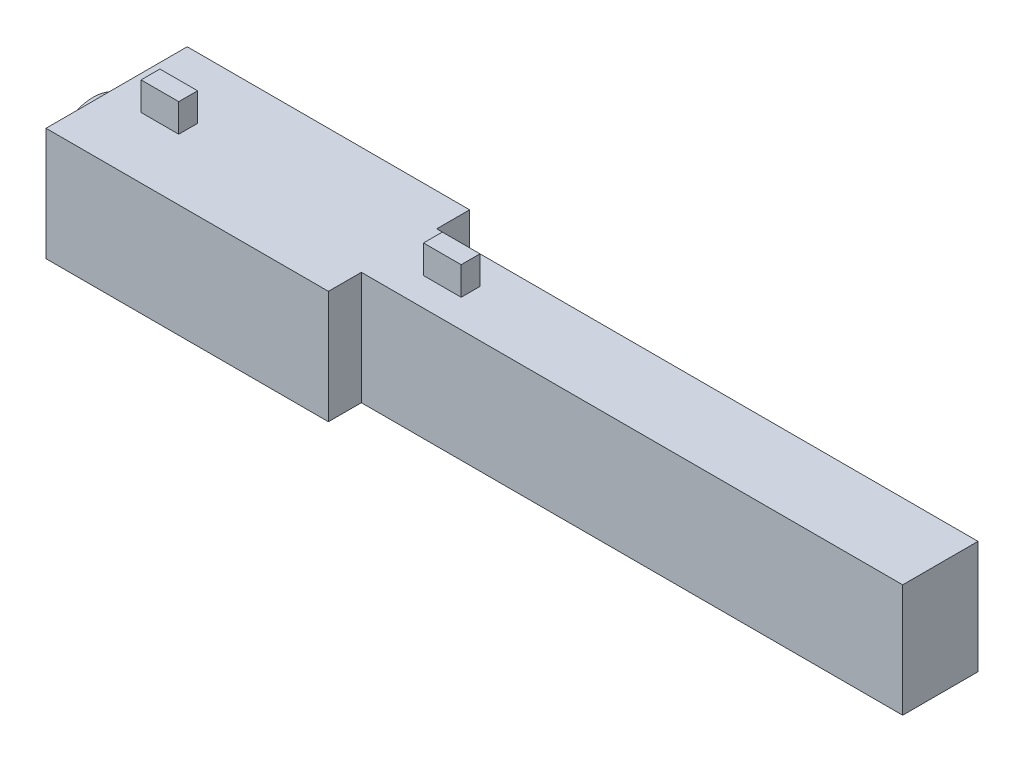
ISO-10303-21;
HEADER;
FILE_DESCRIPTION(('STEP AP214'),'2;1');
FILE_NAME('part.step','',(''),(''),'','','');
FILE_SCHEMA(('AUTOMOTIVE_DESIGN { 1 0 10303 214 1 1 1 1 }'));
ENDSEC;
DATA;
#1=APPLICATION_CONTEXT('core data for automotive mechanical design processes');
#2=APPLICATION_PROTOCOL_DEFINITION('international standard','automotive_design',2000,#1);
#3=PRODUCT_CONTEXT('',#1,'mechanical');
#4=PRODUCT('Part','Part','',(#3));
#5=PRODUCT_RELATED_PRODUCT_CATEGORY('part','',(#4));
#6=PRODUCT_DEFINITION_FORMATION('','',#4);
#7=PRODUCT_DEFINITION_CONTEXT('part definition',#1,'design');
#8=PRODUCT_DEFINITION('design','',#6,#7);
#9=PRODUCT_DEFINITION_SHAPE('','',#8);
#10=(LENGTH_UNIT() NAMED_UNIT(*) SI_UNIT(.MILLI.,.METRE.));
#11=(NAMED_UNIT(*) PLANE_ANGLE_UNIT() SI_UNIT($,.RADIAN.));
#12=(NAMED_UNIT(*) SI_UNIT($,.STERADIAN.) SOLID_ANGLE_UNIT());
#13=UNCERTAINTY_MEASURE_WITH_UNIT(LENGTH_MEASURE(1.E-05),#10,'distance_accuracy_value','');
#14=(GEOMETRIC_REPRESENTATION_CONTEXT(3) GLOBAL_UNCERTAINTY_ASSIGNED_CONTEXT((#13)) GLOBAL_UNIT_ASSIGNED_CONTEXT((#10,
#11,#12)) REPRESENTATION_CONTEXT('',''));
#15=CARTESIAN_POINT('',(0.,0.,0.));
#16=DIRECTION('',(0.,0.,1.));
#17=DIRECTION('',(1.,0.,0.));
#18=AXIS2_PLACEMENT_3D('',#15,#16,#17);
#19=CARTESIAN_POINT('',(-55.5,0.,-7.5));
#20=DIRECTION('',(-1.,0.,0.));
#21=DIRECTION('',(0.,0.,1.));
#22=AXIS2_PLACEMENT_3D('',#19,#20,#21);
#23=PLANE('',#22);
#24=DIRECTION('',(0.,0.,1.));
#25=VECTOR('',#24,1.);
#26=CARTESIAN_POINT('',(-55.5,-6.65,-7.5));
#27=LINE('',#26,#25);
#28=CARTESIAN_POINT('',(-55.5,-6.65,-7.5));
#29=VERTEX_POINT('',#28);
#30=CARTESIAN_POINT('',(-55.5,-6.65,7.5));
#31=VERTEX_POINT('',#30);
#32=EDGE_CURVE('E387',#29,#31,#27,.T.);
#33=ORIENTED_EDGE('',*,*,#32,.T.);
#34=DIRECTION('',(0.,-1.,0.));
#35=VECTOR('',#34,1.);
#36=CARTESIAN_POINT('',(-55.5,0.,7.5));
#37=LINE('',#36,#35);
#38=CARTESIAN_POINT('',(-55.5,5.35,7.5));
#39=VERTEX_POINT('',#38);
#40=EDGE_CURVE('E370',#39,#31,#37,.T.);
#41=ORIENTED_EDGE('',*,*,#40,.F.);
#42=DIRECTION('',(0.,0.,1.));
#43=VECTOR('',#42,1.);
#44=CARTESIAN_POINT('',(-55.5,5.35,-7.5));
#45=LINE('',#44,#43);
#46=CARTESIAN_POINT('',(-55.5,5.35,-7.5));
#47=VERTEX_POINT('',#46);
#48=EDGE_CURVE('E388',#47,#39,#45,.T.);
#49=ORIENTED_EDGE('',*,*,#48,.F.);
#50=DIRECTION('',(0.,-1.,0.));
#51=VECTOR('',#50,1.);
#52=CARTESIAN_POINT('',(-55.5,0.,-7.5));
#53=LINE('',#52,#51);
#54=EDGE_CURVE('E380',#47,#29,#53,.T.);
#55=ORIENTED_EDGE('',*,*,#54,.T.);
#56=EDGE_LOOP('',(#33,#41,#49,#55));
#57=FACE_BOUND('',#56,.T.);
#58=CARTESIAN_POINT('',(-55.5,-1.3,0.));
#59=DIRECTION('',(-1.,0.,0.));
#60=DIRECTION('',(0.,0.,1.));
#61=AXIS2_PLACEMENT_3D('',#58,#59,#60);
#62=CIRCLE('',#61,4.5);
#63=CARTESIAN_POINT('',(-55.5,-1.3,4.5));
#64=VERTEX_POINT('',#63);
#65=EDGE_CURVE('E653',#64,#64,#62,.T.);
#66=ORIENTED_EDGE('',*,*,#65,.F.);
#67=EDGE_LOOP('',(#66));
#68=FACE_BOUND('',#67,.T.);
#69=ADVANCED_FACE('F47',(#57,#68),#23,.T.);
#70=CARTESIAN_POINT('',(0.,-6.65,-7.5));
#71=DIRECTION('',(0.,-1.,0.));
#72=DIRECTION('',(0.,0.,-1.));
#73=AXIS2_PLACEMENT_3D('',#70,#71,#72);
#74=PLANE('',#73);
#75=DIRECTION('',(0.,0.,1.));
#76=VECTOR('',#75,1.);
#77=CARTESIAN_POINT('',(-25.5,-6.65,-7.5));
#78=LINE('',#77,#76);
#79=CARTESIAN_POINT('',(-25.5,-6.65,-7.5));
#80=VERTEX_POINT('',#79);
#81=CARTESIAN_POINT('',(-25.5,-6.65,-4.));
#82=VERTEX_POINT('',#81);
#83=EDGE_CURVE('E13',#80,#82,#78,.T.);
#84=ORIENTED_EDGE('',*,*,#83,.T.);
#85=DIRECTION('',(1.,0.,0.));
#86=VECTOR('',#85,1.);
#87=CARTESIAN_POINT('',(0.,-6.65,-4.));
#88=LINE('',#87,#86);
#89=CARTESIAN_POINT('',(32.,-6.65,-4.));
#90=VERTEX_POINT('',#89);
#91=EDGE_CURVE('E354',#82,#90,#88,.T.);
#92=ORIENTED_EDGE('',*,*,#91,.T.);
#93=DIRECTION('',(0.,0.,1.));
#94=VECTOR('',#93,1.);
#95=CARTESIAN_POINT('',(32.,-6.65,-4.));
#96=LINE('',#95,#94);
#97=CARTESIAN_POINT('',(32.,-6.65,4.));
#98=VERTEX_POINT('',#97);
#99=EDGE_CURVE('E360',#90,#98,#96,.T.);
#100=ORIENTED_EDGE('',*,*,#99,.T.);
#101=DIRECTION('',(1.,0.,0.));
#102=VECTOR('',#101,1.);
#103=CARTESIAN_POINT('',(0.,-6.65,4.));
#104=LINE('',#103,#102);
#105=CARTESIAN_POINT('',(-25.5,-6.65,4.));
#106=VERTEX_POINT('',#105);
#107=EDGE_CURVE('E343',#106,#98,#104,.T.);
#108=ORIENTED_EDGE('',*,*,#107,.F.);
#109=CARTESIAN_POINT('',(-25.5,-6.65,7.5));
#110=VERTEX_POINT('',#109);
#111=EDGE_CURVE('E56',#106,#110,#78,.T.);
#112=ORIENTED_EDGE('',*,*,#111,.T.);
#113=DIRECTION('',(1.,0.,0.));
#114=VECTOR('',#113,1.);
#115=CARTESIAN_POINT('',(0.,-6.65,7.5));
#116=LINE('',#115,#114);
#117=EDGE_CURVE('E373',#31,#110,#116,.T.);
#118=ORIENTED_EDGE('',*,*,#117,.F.);
#119=ORIENTED_EDGE('',*,*,#32,.F.);
#120=DIRECTION('',(1.,0.,0.));
#121=VECTOR('',#120,1.);
#122=CARTESIAN_POINT('',(0.,-6.65,-7.5));
#123=LINE('',#122,#121);
#124=EDGE_CURVE('E383',#29,#80,#123,.T.);
#125=ORIENTED_EDGE('',*,*,#124,.T.);
#126=EDGE_LOOP('',(#84,#92,#100,#108,#112,#118,#119,#125));
#127=FACE_BOUND('',#126,.T.);
#128=DIRECTION('',(-1.,0.,0.));
#129=VECTOR('',#128,1.);
#130=CARTESIAN_POINT('',(-51.9,-6.65,1.));
#131=LINE('',#130,#129);
#132=CARTESIAN_POINT('',(-47.9,-6.65,1.));
#133=VERTEX_POINT('',#132);
#134=CARTESIAN_POINT('',(-51.9,-6.65,1.));
#135=VERTEX_POINT('',#134);
#136=EDGE_CURVE('E293',#133,#135,#131,.T.);
#137=ORIENTED_EDGE('',*,*,#136,.F.);
#138=DIRECTION('',(0.,0.,1.));
#139=VECTOR('',#138,1.);
#140=CARTESIAN_POINT('',(-47.9,-6.65,0.));
#141=LINE('',#140,#139);
#142=CARTESIAN_POINT('',(-47.9,-6.65,-1.));
#143=VERTEX_POINT('',#142);
#144=EDGE_CURVE('E275',#143,#133,#141,.T.);
#145=ORIENTED_EDGE('',*,*,#144,.F.);
#146=DIRECTION('',(1.,0.,0.));
#147=VECTOR('',#146,1.);
#148=CARTESIAN_POINT('',(-47.9,-6.65,-1.));
#149=LINE('',#148,#147);
#150=CARTESIAN_POINT('',(-51.9,-6.65,-1.));
#151=VERTEX_POINT('',#150);
#152=EDGE_CURVE('E285',#151,#143,#149,.T.);
#153=ORIENTED_EDGE('',*,*,#152,.F.);
#154=DIRECTION('',(0.,0.,-1.));
#155=VECTOR('',#154,1.);
#156=CARTESIAN_POINT('',(-51.9,-6.65,0.));
#157=LINE('',#156,#155);
#158=EDGE_CURVE('E295',#135,#151,#157,.T.);
#159=ORIENTED_EDGE('',*,*,#158,.F.);
#160=EDGE_LOOP('',(#137,#145,#153,#159));
#161=FACE_BOUND('',#160,.T.);
#162=DIRECTION('',(0.,0.,1.));
#163=VECTOR('',#162,1.);
#164=CARTESIAN_POINT('',(-17.9,-6.65,0.));
#165=LINE('',#164,#163);
#166=CARTESIAN_POINT('',(-17.9,-6.65,-1.));
#167=VERTEX_POINT('',#166);
#168=CARTESIAN_POINT('',(-17.9,-6.65,1.));
#169=VERTEX_POINT('',#168);
#170=EDGE_CURVE('E323',#167,#169,#165,.T.);
#171=ORIENTED_EDGE('',*,*,#170,.F.);
#172=DIRECTION('',(1.,0.,0.));
#173=VECTOR('',#172,1.);
#174=CARTESIAN_POINT('',(-21.9,-6.65,-1.));
#175=LINE('',#174,#173);
#176=CARTESIAN_POINT('',(-21.9,-6.65,-1.));
#177=VERTEX_POINT('',#176);
#178=EDGE_CURVE('E309',#177,#167,#175,.T.);
#179=ORIENTED_EDGE('',*,*,#178,.F.);
#180=DIRECTION('',(0.,0.,-1.));
#181=VECTOR('',#180,1.);
#182=CARTESIAN_POINT('',(-21.9,-6.65,1.));
#183=LINE('',#182,#181);
#184=CARTESIAN_POINT('',(-21.9,-6.65,1.));
#185=VERTEX_POINT('',#184);
#186=EDGE_CURVE('E314',#185,#177,#183,.T.);
#187=ORIENTED_EDGE('',*,*,#186,.F.);
#188=DIRECTION('',(-1.,0.,0.));
#189=VECTOR('',#188,1.);
#190=CARTESIAN_POINT('',(-17.9,-6.65,1.));
#191=LINE('',#190,#189);
#192=EDGE_CURVE('E325',#169,#185,#191,.T.);
#193=ORIENTED_EDGE('',*,*,#192,.F.);
#194=EDGE_LOOP('',(#171,#179,#187,#193));
#195=FACE_BOUND('',#194,.T.);
#196=ADVANCED_FACE('F435',(#127,#161,#195),#74,.T.);
#197=CARTESIAN_POINT('',(-25.5,0.,-7.5));
#198=DIRECTION('',(-1.,0.,0.));
#199=DIRECTION('',(0.,0.,1.));
#200=AXIS2_PLACEMENT_3D('',#197,#198,#199);
#201=PLANE('',#200);
#202=DIRECTION('',(0.,-1.,0.));
#203=VECTOR('',#202,1.);
#204=CARTESIAN_POINT('',(-25.5,0.,4.));
#205=LINE('',#204,#203);
#206=CARTESIAN_POINT('',(-25.5,5.35,4.));
#207=VERTEX_POINT('',#206);
#208=EDGE_CURVE('E341',#207,#106,#205,.T.);
#209=ORIENTED_EDGE('',*,*,#208,.F.);
#210=DIRECTION('',(0.,0.,1.));
#211=VECTOR('',#210,1.);
#212=CARTESIAN_POINT('',(-25.5,5.35,-7.5));
#213=LINE('',#212,#211);
#214=CARTESIAN_POINT('',(-25.5,5.35,7.5));
#215=VERTEX_POINT('',#214);
#216=EDGE_CURVE('E385',#207,#215,#213,.T.);
#217=ORIENTED_EDGE('',*,*,#216,.T.);
#218=DIRECTION('',(0.,-1.,0.));
#219=VECTOR('',#218,1.);
#220=CARTESIAN_POINT('',(-25.5,0.,7.5));
#221=LINE('',#220,#219);
#222=EDGE_CURVE('E363',#215,#110,#221,.T.);
#223=ORIENTED_EDGE('',*,*,#222,.T.);
#224=ORIENTED_EDGE('',*,*,#111,.F.);
#225=EDGE_LOOP('',(#209,#217,#223,#224));
#226=FACE_BOUND('',#225,.T.);
#227=ADVANCED_FACE('F400',(#226),#201,.F.);
#228=CARTESIAN_POINT('',(-25.5,5.35,-7.5));
#229=VERTEX_POINT('',#228);
#230=CARTESIAN_POINT('',(-25.5,5.35,-4.));
#231=VERTEX_POINT('',#230);
#232=EDGE_CURVE('E51',#229,#231,#213,.T.);
#233=ORIENTED_EDGE('',*,*,#232,.T.);
#234=DIRECTION('',(0.,-1.,0.));
#235=VECTOR('',#234,1.);
#236=CARTESIAN_POINT('',(-25.5,0.,-4.));
#237=LINE('',#236,#235);
#238=EDGE_CURVE('E351',#231,#82,#237,.T.);
#239=ORIENTED_EDGE('',*,*,#238,.T.);
#240=ORIENTED_EDGE('',*,*,#83,.F.);
#241=DIRECTION('',(0.,-1.,0.));
#242=VECTOR('',#241,1.);
#243=CARTESIAN_POINT('',(-25.5,0.,-7.5));
#244=LINE('',#243,#242);
#245=EDGE_CURVE('E376',#229,#80,#244,.T.);
#246=ORIENTED_EDGE('',*,*,#245,.F.);
#247=EDGE_LOOP('',(#233,#239,#240,#246));
#248=FACE_BOUND('',#247,.T.);
#249=ADVANCED_FACE('F49',(#248),#201,.F.);
#250=CARTESIAN_POINT('',(0.,5.35,-7.5));
#251=DIRECTION('',(0.,-1.,0.));
#252=DIRECTION('',(0.,0.,-1.));
#253=AXIS2_PLACEMENT_3D('',#250,#251,#252);
#254=PLANE('',#253);
#255=DIRECTION('',(0.,0.,-1.));
#256=VECTOR('',#255,1.);
#257=CARTESIAN_POINT('',(-51.9,5.35,0.));
#258=LINE('',#257,#256);
#259=CARTESIAN_POINT('',(-51.9,5.35,0.999999999999999));
#260=VERTEX_POINT('',#259);
#261=CARTESIAN_POINT('',(-51.9,5.35,-1.));
#262=VERTEX_POINT('',#261);
#263=EDGE_CURVE('E242',#260,#262,#258,.T.);
#264=ORIENTED_EDGE('',*,*,#263,.T.);
#265=DIRECTION('',(1.,0.,0.));
#266=VECTOR('',#265,1.);
#267=CARTESIAN_POINT('',(-51.9,5.35,-1.));
#268=LINE('',#267,#266);
#269=CARTESIAN_POINT('',(-47.9,5.35,-0.999999999999999));
#270=VERTEX_POINT('',#269);
#271=EDGE_CURVE('E223',#262,#270,#268,.T.);
#272=ORIENTED_EDGE('',*,*,#271,.T.);
#273=DIRECTION('',(0.,0.,1.));
#274=VECTOR('',#273,1.);
#275=CARTESIAN_POINT('',(-47.9,5.35,0.));
#276=LINE('',#275,#274);
#277=CARTESIAN_POINT('',(-47.9,5.35,0.999999999999999));
#278=VERTEX_POINT('',#277);
#279=EDGE_CURVE('E238',#270,#278,#276,.T.);
#280=ORIENTED_EDGE('',*,*,#279,.T.);
#281=DIRECTION('',(-1.,0.,0.));
#282=VECTOR('',#281,1.);
#283=CARTESIAN_POINT('',(-47.9,5.35,0.999999999999999));
#284=LINE('',#283,#282);
#285=EDGE_CURVE('E64',#278,#260,#284,.T.);
#286=ORIENTED_EDGE('',*,*,#285,.T.);
#287=EDGE_LOOP('',(#264,#272,#280,#286));
#288=FACE_BOUND('',#287,.T.);
#289=ORIENTED_EDGE('',*,*,#216,.F.);
#290=DIRECTION('',(1.,0.,0.));
#291=VECTOR('',#290,1.);
#292=CARTESIAN_POINT('',(0.,5.35,4.));
#293=LINE('',#292,#291);
#294=CARTESIAN_POINT('',(32.,5.35,4.));
#295=VERTEX_POINT('',#294);
#296=EDGE_CURVE('E338',#207,#295,#293,.T.);
#297=ORIENTED_EDGE('',*,*,#296,.T.);
#298=DIRECTION('',(0.,0.,1.));
#299=VECTOR('',#298,1.);
#300=CARTESIAN_POINT('',(32.,5.35,-4.));
#301=LINE('',#300,#299);
#302=CARTESIAN_POINT('',(32.,5.35,-4.));
#303=VERTEX_POINT('',#302);
#304=EDGE_CURVE('E361',#303,#295,#301,.T.);
#305=ORIENTED_EDGE('',*,*,#304,.F.);
#306=DIRECTION('',(1.,0.,0.));
#307=VECTOR('',#306,1.);
#308=CARTESIAN_POINT('',(0.,5.35,-4.));
#309=LINE('',#308,#307);
#310=EDGE_CURVE('E349',#231,#303,#309,.T.);
#311=ORIENTED_EDGE('',*,*,#310,.F.);
#312=ORIENTED_EDGE('',*,*,#232,.F.);
#313=DIRECTION('',(1.,0.,0.));
#314=VECTOR('',#313,1.);
#315=CARTESIAN_POINT('',(0.,5.35,-7.5));
#316=LINE('',#315,#314);
#317=EDGE_CURVE('E378',#47,#229,#316,.T.);
#318=ORIENTED_EDGE('',*,*,#317,.F.);
#319=ORIENTED_EDGE('',*,*,#48,.T.);
#320=DIRECTION('',(1.,0.,0.));
#321=VECTOR('',#320,1.);
#322=CARTESIAN_POINT('',(0.,5.35,7.5));
#323=LINE('',#322,#321);
#324=EDGE_CURVE('E367',#39,#215,#323,.T.);
#325=ORIENTED_EDGE('',*,*,#324,.T.);
#326=EDGE_LOOP('',(#289,#297,#305,#311,#312,#318,#319,#325));
#327=FACE_BOUND('',#326,.T.);
#328=DIRECTION('',(0.,0.,-1.));
#329=VECTOR('',#328,1.);
#330=CARTESIAN_POINT('',(-21.9,5.35,0.999999999999999));
#331=LINE('',#330,#329);
#332=CARTESIAN_POINT('',(-21.9,5.35,0.999999999999999));
#333=VERTEX_POINT('',#332);
#334=CARTESIAN_POINT('',(-21.9,5.35,-0.999999999999997));
#335=VERTEX_POINT('',#334);
#336=EDGE_CURVE('E256',#333,#335,#331,.T.);
#337=ORIENTED_EDGE('',*,*,#336,.T.);
#338=DIRECTION('',(1.,0.,0.));
#339=VECTOR('',#338,1.);
#340=CARTESIAN_POINT('',(-21.9,5.35,-0.999999999999997));
#341=LINE('',#340,#339);
#342=CARTESIAN_POINT('',(-17.9,5.35,-0.999999999999997));
#343=VERTEX_POINT('',#342);
#344=EDGE_CURVE('E248',#335,#343,#341,.T.);
#345=ORIENTED_EDGE('',*,*,#344,.T.);
#346=DIRECTION('',(0.,0.,1.));
#347=VECTOR('',#346,1.);
#348=CARTESIAN_POINT('',(-17.9,5.35,0.));
#349=LINE('',#348,#347);
#350=CARTESIAN_POINT('',(-17.9,5.35,0.999999999999999));
#351=VERTEX_POINT('',#350);
#352=EDGE_CURVE('E267',#343,#351,#349,.T.);
#353=ORIENTED_EDGE('',*,*,#352,.T.);
#354=DIRECTION('',(-1.,0.,0.));
#355=VECTOR('',#354,1.);
#356=CARTESIAN_POINT('',(-17.9,5.35,0.999999999999999));
#357=LINE('',#356,#355);
#358=EDGE_CURVE('E72',#351,#333,#357,.T.);
#359=ORIENTED_EDGE('',*,*,#358,.T.);
#360=EDGE_LOOP('',(#337,#345,#353,#359));
#361=FACE_BOUND('',#360,.T.);
#362=ADVANCED_FACE('F406',(#288,#327,#361),#254,.F.);
#363=CARTESIAN_POINT('',(0.,0.,-7.5));
#364=DIRECTION('',(0.,0.,1.));
#365=DIRECTION('',(1.,0.,0.));
#366=AXIS2_PLACEMENT_3D('',#363,#364,#365);
#367=PLANE('',#366);
#368=ORIENTED_EDGE('',*,*,#245,.T.);
#369=ORIENTED_EDGE('',*,*,#124,.F.);
#370=ORIENTED_EDGE('',*,*,#54,.F.);
#371=ORIENTED_EDGE('',*,*,#317,.T.);
#372=EDGE_LOOP('',(#368,#369,#370,#371));
#373=FACE_BOUND('',#372,.T.);
#374=ADVANCED_FACE('F409',(#373),#367,.F.);
#375=CARTESIAN_POINT('',(0.,0.,7.5));
#376=DIRECTION('',(0.,0.,1.));
#377=DIRECTION('',(1.,0.,0.));
#378=AXIS2_PLACEMENT_3D('',#375,#376,#377);
#379=PLANE('',#378);
#380=ORIENTED_EDGE('',*,*,#222,.F.);
#381=ORIENTED_EDGE('',*,*,#324,.F.);
#382=ORIENTED_EDGE('',*,*,#40,.T.);
#383=ORIENTED_EDGE('',*,*,#117,.T.);
#384=EDGE_LOOP('',(#380,#381,#382,#383));
#385=FACE_BOUND('',#384,.T.);
#386=ADVANCED_FACE('F404',(#385),#379,.T.);
#387=CARTESIAN_POINT('',(32.,0.,-4.));
#388=DIRECTION('',(1.,0.,0.));
#389=DIRECTION('',(0.,0.,-1.));
#390=AXIS2_PLACEMENT_3D('',#387,#388,#389);
#391=PLANE('',#390);
#392=ORIENTED_EDGE('',*,*,#304,.T.);
#393=DIRECTION('',(0.,1.,0.));
#394=VECTOR('',#393,1.);
#395=CARTESIAN_POINT('',(32.,0.,4.));
#396=LINE('',#395,#394);
#397=EDGE_CURVE('E346',#98,#295,#396,.T.);
#398=ORIENTED_EDGE('',*,*,#397,.F.);
#399=ORIENTED_EDGE('',*,*,#99,.F.);
#400=DIRECTION('',(0.,1.,0.));
#401=VECTOR('',#400,1.);
#402=CARTESIAN_POINT('',(32.,0.,-4.));
#403=LINE('',#402,#401);
#404=EDGE_CURVE('E357',#90,#303,#403,.T.);
#405=ORIENTED_EDGE('',*,*,#404,.T.);
#406=EDGE_LOOP('',(#392,#398,#399,#405));
#407=FACE_BOUND('',#406,.T.);
#408=ADVANCED_FACE('F450',(#407),#391,.T.);
#409=CARTESIAN_POINT('',(0.,0.,-4.));
#410=DIRECTION('',(0.,0.,1.));
#411=DIRECTION('',(1.,0.,0.));
#412=AXIS2_PLACEMENT_3D('',#409,#410,#411);
#413=PLANE('',#412);
#414=ORIENTED_EDGE('',*,*,#310,.T.);
#415=ORIENTED_EDGE('',*,*,#404,.F.);
#416=ORIENTED_EDGE('',*,*,#91,.F.);
#417=ORIENTED_EDGE('',*,*,#238,.F.);
#418=EDGE_LOOP('',(#414,#415,#416,#417));
#419=FACE_BOUND('',#418,.T.);
#420=ADVANCED_FACE('F453',(#419),#413,.F.);
#421=CARTESIAN_POINT('',(0.,0.,4.));
#422=DIRECTION('',(0.,0.,1.));
#423=DIRECTION('',(1.,0.,0.));
#424=AXIS2_PLACEMENT_3D('',#421,#422,#423);
#425=PLANE('',#424);
#426=ORIENTED_EDGE('',*,*,#296,.F.);
#427=ORIENTED_EDGE('',*,*,#208,.T.);
#428=ORIENTED_EDGE('',*,*,#107,.T.);
#429=ORIENTED_EDGE('',*,*,#397,.T.);
#430=EDGE_LOOP('',(#426,#427,#428,#429));
#431=FACE_BOUND('',#430,.T.);
#432=ADVANCED_FACE('F457',(#431),#425,.T.);
#433=CARTESIAN_POINT('',(-21.9,-9.65,-1.));
#434=DIRECTION('',(0.,0.,1.));
#435=DIRECTION('',(1.,0.,0.));
#436=AXIS2_PLACEMENT_3D('',#433,#434,#435);
#437=PLANE('',#436);
#438=ORIENTED_EDGE('',*,*,#178,.T.);
#439=DIRECTION('',(0.,1.,0.));
#440=VECTOR('',#439,1.);
#441=CARTESIAN_POINT('',(-17.9,-9.65,-1.));
#442=LINE('',#441,#440);
#443=CARTESIAN_POINT('',(-17.9,-9.65,-1.));
#444=VERTEX_POINT('',#443);
#445=EDGE_CURVE('E336',#444,#167,#442,.T.);
#446=ORIENTED_EDGE('',*,*,#445,.F.);
#447=DIRECTION('',(1.,0.,0.));
#448=VECTOR('',#447,1.);
#449=CARTESIAN_POINT('',(-21.9,-9.65,-1.));
#450=LINE('',#449,#448);
#451=CARTESIAN_POINT('',(-21.9,-9.65,-1.));
#452=VERTEX_POINT('',#451);
#453=EDGE_CURVE('E310',#452,#444,#450,.T.);
#454=ORIENTED_EDGE('',*,*,#453,.F.);
#455=DIRECTION('',(0.,1.,0.));
#456=VECTOR('',#455,1.);
#457=CARTESIAN_POINT('',(-21.9,-9.65,-1.));
#458=LINE('',#457,#456);
#459=EDGE_CURVE('E320',#452,#177,#458,.T.);
#460=ORIENTED_EDGE('',*,*,#459,.T.);
#461=EDGE_LOOP('',(#438,#446,#454,#460));
#462=FACE_BOUND('',#461,.T.);
#463=ADVANCED_FACE('F461',(#462),#437,.F.);
#464=CARTESIAN_POINT('',(-17.9,-9.65,0.));
#465=DIRECTION('',(-1.,0.,0.));
#466=DIRECTION('',(0.,0.,1.));
#467=AXIS2_PLACEMENT_3D('',#464,#465,#466);
#468=PLANE('',#467);
#469=ORIENTED_EDGE('',*,*,#170,.T.);
#470=DIRECTION('',(0.,1.,0.));
#471=VECTOR('',#470,1.);
#472=CARTESIAN_POINT('',(-17.9,-9.65,1.));
#473=LINE('',#472,#471);
#474=CARTESIAN_POINT('',(-17.9,-9.65,1.));
#475=VERTEX_POINT('',#474);
#476=EDGE_CURVE('E333',#475,#169,#473,.T.);
#477=ORIENTED_EDGE('',*,*,#476,.F.);
#478=DIRECTION('',(0.,0.,1.));
#479=VECTOR('',#478,1.);
#480=CARTESIAN_POINT('',(-17.9,-9.65,-1.));
#481=LINE('',#480,#479);
#482=EDGE_CURVE('E313',#444,#475,#481,.T.);
#483=ORIENTED_EDGE('',*,*,#482,.F.);
#484=ORIENTED_EDGE('',*,*,#445,.T.);
#485=EDGE_LOOP('',(#469,#477,#483,#484));
#486=FACE_BOUND('',#485,.T.);
#487=ADVANCED_FACE('F465',(#486),#468,.F.);
#488=CARTESIAN_POINT('',(-17.9,-9.65,1.));
#489=DIRECTION('',(0.,0.,-1.));
#490=DIRECTION('',(-1.,0.,0.));
#491=AXIS2_PLACEMENT_3D('',#488,#489,#490);
#492=PLANE('',#491);
#493=ORIENTED_EDGE('',*,*,#192,.T.);
#494=DIRECTION('',(0.,1.,0.));
#495=VECTOR('',#494,1.);
#496=CARTESIAN_POINT('',(-21.9,-9.65,1.));
#497=LINE('',#496,#495);
#498=CARTESIAN_POINT('',(-21.9,-9.65,1.));
#499=VERTEX_POINT('',#498);
#500=EDGE_CURVE('E331',#499,#185,#497,.T.);
#501=ORIENTED_EDGE('',*,*,#500,.F.);
#502=DIRECTION('',(-1.,0.,0.));
#503=VECTOR('',#502,1.);
#504=CARTESIAN_POINT('',(-17.9,-9.65,1.));
#505=LINE('',#504,#503);
#506=EDGE_CURVE('E316',#475,#499,#505,.T.);
#507=ORIENTED_EDGE('',*,*,#506,.F.);
#508=ORIENTED_EDGE('',*,*,#476,.T.);
#509=EDGE_LOOP('',(#493,#501,#507,#508));
#510=FACE_BOUND('',#509,.T.);
#511=ADVANCED_FACE('F469',(#510),#492,.F.);
#512=CARTESIAN_POINT('',(-21.9,-9.65,1.));
#513=DIRECTION('',(1.,0.,0.));
#514=DIRECTION('',(0.,0.,-1.));
#515=AXIS2_PLACEMENT_3D('',#512,#513,#514);
#516=PLANE('',#515);
#517=ORIENTED_EDGE('',*,*,#186,.T.);
#518=ORIENTED_EDGE('',*,*,#459,.F.);
#519=DIRECTION('',(0.,0.,-1.));
#520=VECTOR('',#519,1.);
#521=CARTESIAN_POINT('',(-21.9,-9.65,1.));
#522=LINE('',#521,#520);
#523=EDGE_CURVE('E318',#499,#452,#522,.T.);
#524=ORIENTED_EDGE('',*,*,#523,.F.);
#525=ORIENTED_EDGE('',*,*,#500,.T.);
#526=EDGE_LOOP('',(#517,#518,#524,#525));
#527=FACE_BOUND('',#526,.T.);
#528=ADVANCED_FACE('F473',(#527),#516,.F.);
#529=CARTESIAN_POINT('',(0.,-9.65,0.));
#530=DIRECTION('',(0.,-1.,0.));
#531=DIRECTION('',(0.,0.,-1.));
#532=AXIS2_PLACEMENT_3D('',#529,#530,#531);
#533=PLANE('',#532);
#534=ORIENTED_EDGE('',*,*,#453,.T.);
#535=ORIENTED_EDGE('',*,*,#482,.T.);
#536=ORIENTED_EDGE('',*,*,#506,.T.);
#537=ORIENTED_EDGE('',*,*,#523,.T.);
#538=EDGE_LOOP('',(#534,#535,#536,#537));
#539=FACE_BOUND('',#538,.T.);
#540=ADVANCED_FACE('F477',(#539),#533,.T.);
#541=CARTESIAN_POINT('',(-47.9,-9.65,0.));
#542=DIRECTION('',(-1.,0.,0.));
#543=DIRECTION('',(0.,0.,1.));
#544=AXIS2_PLACEMENT_3D('',#541,#542,#543);
#545=PLANE('',#544);
#546=ORIENTED_EDGE('',*,*,#144,.T.);
#547=DIRECTION('',(0.,1.,0.));
#548=VECTOR('',#547,1.);
#549=CARTESIAN_POINT('',(-47.9,-9.65,1.));
#550=LINE('',#549,#548);
#551=CARTESIAN_POINT('',(-47.9,-9.65,1.));
#552=VERTEX_POINT('',#551);
#553=EDGE_CURVE('E306',#552,#133,#550,.T.);
#554=ORIENTED_EDGE('',*,*,#553,.F.);
#555=DIRECTION('',(0.,0.,1.));
#556=VECTOR('',#555,1.);
#557=CARTESIAN_POINT('',(-47.9,-9.65,0.));
#558=LINE('',#557,#556);
#559=CARTESIAN_POINT('',(-47.9,-9.65,-1.));
#560=VERTEX_POINT('',#559);
#561=EDGE_CURVE('E282',#560,#552,#558,.T.);
#562=ORIENTED_EDGE('',*,*,#561,.F.);
#563=DIRECTION('',(0.,1.,0.));
#564=VECTOR('',#563,1.);
#565=CARTESIAN_POINT('',(-47.9,-9.65,-1.));
#566=LINE('',#565,#564);
#567=EDGE_CURVE('E291',#560,#143,#566,.T.);
#568=ORIENTED_EDGE('',*,*,#567,.T.);
#569=EDGE_LOOP('',(#546,#554,#562,#568));
#570=FACE_BOUND('',#569,.T.);
#571=ADVANCED_FACE('F481',(#570),#545,.F.);
#572=CARTESIAN_POINT('',(-51.9,-9.65,1.));
#573=DIRECTION('',(0.,0.,-1.));
#574=DIRECTION('',(-1.,0.,0.));
#575=AXIS2_PLACEMENT_3D('',#572,#573,#574);
#576=PLANE('',#575);
#577=ORIENTED_EDGE('',*,*,#136,.T.);
#578=DIRECTION('',(0.,1.,0.));
#579=VECTOR('',#578,1.);
#580=CARTESIAN_POINT('',(-51.9,-9.65,1.));
#581=LINE('',#580,#579);
#582=CARTESIAN_POINT('',(-51.9,-9.65,1.));
#583=VERTEX_POINT('',#582);
#584=EDGE_CURVE('E303',#583,#135,#581,.T.);
#585=ORIENTED_EDGE('',*,*,#584,.F.);
#586=DIRECTION('',(-1.,0.,0.));
#587=VECTOR('',#586,1.);
#588=CARTESIAN_POINT('',(-51.9,-9.65,1.));
#589=LINE('',#588,#587);
#590=EDGE_CURVE('E284',#552,#583,#589,.T.);
#591=ORIENTED_EDGE('',*,*,#590,.F.);
#592=ORIENTED_EDGE('',*,*,#553,.T.);
#593=EDGE_LOOP('',(#577,#585,#591,#592));
#594=FACE_BOUND('',#593,.T.);
#595=ADVANCED_FACE('F485',(#594),#576,.F.);
#596=CARTESIAN_POINT('',(-51.9,-9.65,0.));
#597=DIRECTION('',(1.,0.,0.));
#598=DIRECTION('',(0.,0.,-1.));
#599=AXIS2_PLACEMENT_3D('',#596,#597,#598);
#600=PLANE('',#599);
#601=ORIENTED_EDGE('',*,*,#158,.T.);
#602=DIRECTION('',(0.,1.,0.));
#603=VECTOR('',#602,1.);
#604=CARTESIAN_POINT('',(-51.9,-9.65,-1.));
#605=LINE('',#604,#603);
#606=CARTESIAN_POINT('',(-51.9,-9.65,-1.));
#607=VERTEX_POINT('',#606);
#608=EDGE_CURVE('E301',#607,#151,#605,.T.);
#609=ORIENTED_EDGE('',*,*,#608,.F.);
#610=DIRECTION('',(0.,0.,-1.));
#611=VECTOR('',#610,1.);
#612=CARTESIAN_POINT('',(-51.9,-9.65,0.));
#613=LINE('',#612,#611);
#614=EDGE_CURVE('E287',#583,#607,#613,.T.);
#615=ORIENTED_EDGE('',*,*,#614,.F.);
#616=ORIENTED_EDGE('',*,*,#584,.T.);
#617=EDGE_LOOP('',(#601,#609,#615,#616));
#618=FACE_BOUND('',#617,.T.);
#619=ADVANCED_FACE('F489',(#618),#600,.F.);
#620=CARTESIAN_POINT('',(-47.9,-9.65,-1.));
#621=DIRECTION('',(0.,0.,1.));
#622=DIRECTION('',(1.,0.,0.));
#623=AXIS2_PLACEMENT_3D('',#620,#621,#622);
#624=PLANE('',#623);
#625=ORIENTED_EDGE('',*,*,#152,.T.);
#626=ORIENTED_EDGE('',*,*,#567,.F.);
#627=DIRECTION('',(1.,0.,0.));
#628=VECTOR('',#627,1.);
#629=CARTESIAN_POINT('',(-47.9,-9.65,-1.));
#630=LINE('',#629,#628);
#631=EDGE_CURVE('E289',#607,#560,#630,.T.);
#632=ORIENTED_EDGE('',*,*,#631,.F.);
#633=ORIENTED_EDGE('',*,*,#608,.T.);
#634=EDGE_LOOP('',(#625,#626,#632,#633));
#635=FACE_BOUND('',#634,.T.);
#636=ADVANCED_FACE('F493',(#635),#624,.F.);
#637=CARTESIAN_POINT('',(0.,-9.65,0.));
#638=DIRECTION('',(0.,1.,0.));
#639=DIRECTION('',(0.,0.,1.));
#640=AXIS2_PLACEMENT_3D('',#637,#638,#639);
#641=PLANE('',#640);
#642=ORIENTED_EDGE('',*,*,#561,.T.);
#643=ORIENTED_EDGE('',*,*,#590,.T.);
#644=ORIENTED_EDGE('',*,*,#614,.T.);
#645=ORIENTED_EDGE('',*,*,#631,.T.);
#646=EDGE_LOOP('',(#642,#643,#644,#645));
#647=FACE_BOUND('',#646,.T.);
#648=ADVANCED_FACE('F497',(#647),#641,.F.);
#649=CARTESIAN_POINT('',(-21.9,8.35,-0.999999999999997));
#650=DIRECTION('',(0.,0.,-1.));
#651=DIRECTION('',(-1.,0.,0.));
#652=AXIS2_PLACEMENT_3D('',#649,#650,#651);
#653=PLANE('',#652);
#654=ORIENTED_EDGE('',*,*,#344,.F.);
#655=DIRECTION('',(0.,-1.,0.));
#656=VECTOR('',#655,1.);
#657=CARTESIAN_POINT('',(-21.9,8.35,-0.999999999999997));
#658=LINE('',#657,#656);
#659=CARTESIAN_POINT('',(-21.9,8.35,-0.999999999999997));
#660=VERTEX_POINT('',#659);
#661=EDGE_CURVE('E273',#660,#335,#658,.T.);
#662=ORIENTED_EDGE('',*,*,#661,.F.);
#663=DIRECTION('',(1.,0.,0.));
#664=VECTOR('',#663,1.);
#665=CARTESIAN_POINT('',(-21.9,8.35,-0.999999999999997));
#666=LINE('',#665,#664);
#667=CARTESIAN_POINT('',(-17.9,8.35,-0.999999999999997));
#668=VERTEX_POINT('',#667);
#669=EDGE_CURVE('E252',#660,#668,#666,.T.);
#670=ORIENTED_EDGE('',*,*,#669,.T.);
#671=DIRECTION('',(0.,-1.,0.));
#672=VECTOR('',#671,1.);
#673=CARTESIAN_POINT('',(-17.9,8.35,-0.999999999999997));
#674=LINE('',#673,#672);
#675=EDGE_CURVE('E264',#668,#343,#674,.T.);
#676=ORIENTED_EDGE('',*,*,#675,.T.);
#677=EDGE_LOOP('',(#654,#662,#670,#676));
#678=FACE_BOUND('',#677,.T.);
#679=ADVANCED_FACE('F418',(#678),#653,.T.);
#680=CARTESIAN_POINT('',(-21.9,8.35,0.999999999999999));
#681=DIRECTION('',(-1.,0.,0.));
#682=DIRECTION('',(0.,0.,1.));
#683=AXIS2_PLACEMENT_3D('',#680,#681,#682);
#684=PLANE('',#683);
#685=ORIENTED_EDGE('',*,*,#336,.F.);
#686=DIRECTION('',(0.,-1.,0.));
#687=VECTOR('',#686,1.);
#688=CARTESIAN_POINT('',(-21.9,8.35,0.999999999999999));
#689=LINE('',#688,#687);
#690=CARTESIAN_POINT('',(-21.9,8.35,0.999999999999999));
#691=VERTEX_POINT('',#690);
#692=EDGE_CURVE('E276',#691,#333,#689,.T.);
#693=ORIENTED_EDGE('',*,*,#692,.F.);
#694=DIRECTION('',(0.,0.,-1.));
#695=VECTOR('',#694,1.);
#696=CARTESIAN_POINT('',(-21.9,8.35,0.999999999999999));
#697=LINE('',#696,#695);
#698=EDGE_CURVE('E261',#691,#660,#697,.T.);
#699=ORIENTED_EDGE('',*,*,#698,.T.);
#700=ORIENTED_EDGE('',*,*,#661,.T.);
#701=EDGE_LOOP('',(#685,#693,#699,#700));
#702=FACE_BOUND('',#701,.T.);
#703=ADVANCED_FACE('F414',(#702),#684,.T.);
#704=CARTESIAN_POINT('',(-17.9,8.35,0.999999999999999));
#705=DIRECTION('',(0.,0.,1.));
#706=DIRECTION('',(1.,0.,0.));
#707=AXIS2_PLACEMENT_3D('',#704,#705,#706);
#708=PLANE('',#707);
#709=ORIENTED_EDGE('',*,*,#358,.F.);
#710=DIRECTION('',(0.,-1.,0.));
#711=VECTOR('',#710,1.);
#712=CARTESIAN_POINT('',(-17.9,8.35,0.999999999999999));
#713=LINE('',#712,#711);
#714=CARTESIAN_POINT('',(-17.9,8.35,0.999999999999999));
#715=VERTEX_POINT('',#714);
#716=EDGE_CURVE('E278',#715,#351,#713,.T.);
#717=ORIENTED_EDGE('',*,*,#716,.F.);
#718=DIRECTION('',(-1.,0.,0.));
#719=VECTOR('',#718,1.);
#720=CARTESIAN_POINT('',(-17.9,8.35,0.999999999999999));
#721=LINE('',#720,#719);
#722=EDGE_CURVE('E258',#715,#691,#721,.T.);
#723=ORIENTED_EDGE('',*,*,#722,.T.);
#724=ORIENTED_EDGE('',*,*,#692,.T.);
#725=EDGE_LOOP('',(#709,#717,#723,#724));
#726=FACE_BOUND('',#725,.T.);
#727=ADVANCED_FACE('F425',(#726),#708,.T.);
#728=CARTESIAN_POINT('',(-17.9,8.35,0.));
#729=DIRECTION('',(1.,0.,0.));
#730=DIRECTION('',(0.,0.,-1.));
#731=AXIS2_PLACEMENT_3D('',#728,#729,#730);
#732=PLANE('',#731);
#733=ORIENTED_EDGE('',*,*,#352,.F.);
#734=ORIENTED_EDGE('',*,*,#675,.F.);
#735=DIRECTION('',(0.,0.,1.));
#736=VECTOR('',#735,1.);
#737=CARTESIAN_POINT('',(-17.9,8.35,-0.999999999999997));
#738=LINE('',#737,#736);
#739=EDGE_CURVE('E255',#668,#715,#738,.T.);
#740=ORIENTED_EDGE('',*,*,#739,.T.);
#741=ORIENTED_EDGE('',*,*,#716,.T.);
#742=EDGE_LOOP('',(#733,#734,#740,#741));
#743=FACE_BOUND('',#742,.T.);
#744=ADVANCED_FACE('F421',(#743),#732,.T.);
#745=CARTESIAN_POINT('',(0.,8.35,0.));
#746=DIRECTION('',(0.,-1.,0.));
#747=DIRECTION('',(0.,0.,-1.));
#748=AXIS2_PLACEMENT_3D('',#745,#746,#747);
#749=PLANE('',#748);
#750=ORIENTED_EDGE('',*,*,#669,.F.);
#751=ORIENTED_EDGE('',*,*,#698,.F.);
#752=ORIENTED_EDGE('',*,*,#722,.F.);
#753=ORIENTED_EDGE('',*,*,#739,.F.);
#754=EDGE_LOOP('',(#750,#751,#752,#753));
#755=FACE_BOUND('',#754,.T.);
#756=ADVANCED_FACE('F424',(#755),#749,.F.);
#757=CARTESIAN_POINT('',(-51.9,8.35,-1.));
#758=DIRECTION('',(0.,0.,-1.));
#759=DIRECTION('',(-1.,0.,0.));
#760=AXIS2_PLACEMENT_3D('',#757,#758,#759);
#761=PLANE('',#760);
#762=ORIENTED_EDGE('',*,*,#271,.F.);
#763=DIRECTION('',(0.,-1.,0.));
#764=VECTOR('',#763,1.);
#765=CARTESIAN_POINT('',(-51.9,8.35,-1.));
#766=LINE('',#765,#764);
#767=CARTESIAN_POINT('',(-51.9,8.35,-1.));
#768=VERTEX_POINT('',#767);
#769=EDGE_CURVE('E249',#768,#262,#766,.T.);
#770=ORIENTED_EDGE('',*,*,#769,.F.);
#771=DIRECTION('',(1.,0.,0.));
#772=VECTOR('',#771,1.);
#773=CARTESIAN_POINT('',(-51.9,8.35,-1.));
#774=LINE('',#773,#772);
#775=CARTESIAN_POINT('',(-47.9,8.35,-0.999999999999999));
#776=VERTEX_POINT('',#775);
#777=EDGE_CURVE('E228',#768,#776,#774,.T.);
#778=ORIENTED_EDGE('',*,*,#777,.T.);
#779=DIRECTION('',(0.,-1.,0.));
#780=VECTOR('',#779,1.);
#781=CARTESIAN_POINT('',(-47.9,8.35,-0.999999999999999));
#782=LINE('',#781,#780);
#783=EDGE_CURVE('E217',#776,#270,#782,.T.);
#784=ORIENTED_EDGE('',*,*,#783,.T.);
#785=EDGE_LOOP('',(#762,#770,#778,#784));
#786=FACE_BOUND('',#785,.T.);
#787=ADVANCED_FACE('F531',(#786),#761,.T.);
#788=CARTESIAN_POINT('',(-51.9,8.35,0.));
#789=DIRECTION('',(-1.,0.,0.));
#790=DIRECTION('',(0.,0.,1.));
#791=AXIS2_PLACEMENT_3D('',#788,#789,#790);
#792=PLANE('',#791);
#793=ORIENTED_EDGE('',*,*,#263,.F.);
#794=DIRECTION('',(0.,-1.,0.));
#795=VECTOR('',#794,1.);
#796=CARTESIAN_POINT('',(-51.9,8.35,0.999999999999999));
#797=LINE('',#796,#795);
#798=CARTESIAN_POINT('',(-51.9,8.35,0.999999999999999));
#799=VERTEX_POINT('',#798);
#800=EDGE_CURVE('E227',#799,#260,#797,.T.);
#801=ORIENTED_EDGE('',*,*,#800,.F.);
#802=DIRECTION('',(0.,0.,-1.));
#803=VECTOR('',#802,1.);
#804=CARTESIAN_POINT('',(-51.9,8.35,0.));
#805=LINE('',#804,#803);
#806=EDGE_CURVE('E232',#799,#768,#805,.T.);
#807=ORIENTED_EDGE('',*,*,#806,.T.);
#808=ORIENTED_EDGE('',*,*,#769,.T.);
#809=EDGE_LOOP('',(#793,#801,#807,#808));
#810=FACE_BOUND('',#809,.T.);
#811=ADVANCED_FACE('F540',(#810),#792,.T.);
#812=CARTESIAN_POINT('',(-47.9,8.35,0.999999999999999));
#813=DIRECTION('',(0.,0.,1.));
#814=DIRECTION('',(1.,0.,0.));
#815=AXIS2_PLACEMENT_3D('',#812,#813,#814);
#816=PLANE('',#815);
#817=ORIENTED_EDGE('',*,*,#285,.F.);
#818=DIRECTION('',(0.,-1.,0.));
#819=VECTOR('',#818,1.);
#820=CARTESIAN_POINT('',(-47.9,8.35,0.999999999999999));
#821=LINE('',#820,#819);
#822=CARTESIAN_POINT('',(-47.9,8.35,0.999999999999999));
#823=VERTEX_POINT('',#822);
#824=EDGE_CURVE('E214',#823,#278,#821,.T.);
#825=ORIENTED_EDGE('',*,*,#824,.F.);
#826=DIRECTION('',(-1.,0.,0.));
#827=VECTOR('',#826,1.);
#828=CARTESIAN_POINT('',(-47.9,8.35,0.999999999999999));
#829=LINE('',#828,#827);
#830=EDGE_CURVE('E222',#823,#799,#829,.T.);
#831=ORIENTED_EDGE('',*,*,#830,.T.);
#832=ORIENTED_EDGE('',*,*,#800,.T.);
#833=EDGE_LOOP('',(#817,#825,#831,#832));
#834=FACE_BOUND('',#833,.T.);
#835=ADVANCED_FACE('F226',(#834),#816,.T.);
#836=CARTESIAN_POINT('',(-47.9,8.35,0.));
#837=DIRECTION('',(1.,0.,0.));
#838=DIRECTION('',(0.,0.,-1.));
#839=AXIS2_PLACEMENT_3D('',#836,#837,#838);
#840=PLANE('',#839);
#841=ORIENTED_EDGE('',*,*,#279,.F.);
#842=ORIENTED_EDGE('',*,*,#783,.F.);
#843=DIRECTION('',(0.,0.,1.));
#844=VECTOR('',#843,1.);
#845=CARTESIAN_POINT('',(-47.9,8.35,0.));
#846=LINE('',#845,#844);
#847=EDGE_CURVE('E212',#776,#823,#846,.T.);
#848=ORIENTED_EDGE('',*,*,#847,.T.);
#849=ORIENTED_EDGE('',*,*,#824,.T.);
#850=EDGE_LOOP('',(#841,#842,#848,#849));
#851=FACE_BOUND('',#850,.T.);
#852=ADVANCED_FACE('F213',(#851),#840,.T.);
#853=CARTESIAN_POINT('',(0.,8.35,0.));
#854=DIRECTION('',(0.,-1.,0.));
#855=DIRECTION('',(0.,0.,-1.));
#856=AXIS2_PLACEMENT_3D('',#853,#854,#855);
#857=PLANE('',#856);
#858=ORIENTED_EDGE('',*,*,#847,.F.);
#859=ORIENTED_EDGE('',*,*,#777,.F.);
#860=ORIENTED_EDGE('',*,*,#806,.F.);
#861=ORIENTED_EDGE('',*,*,#830,.F.);
#862=EDGE_LOOP('',(#858,#859,#860,#861));
#863=FACE_BOUND('',#862,.T.);
#864=ADVANCED_FACE('F231',(#863),#857,.F.);
#865=CARTESIAN_POINT('',(-58.,-1.3,0.));
#866=DIRECTION('',(-1.,0.,0.));
#867=DIRECTION('',(0.,0.,1.));
#868=AXIS2_PLACEMENT_3D('',#865,#866,#867);
#869=PLANE('',#868);
#870=CARTESIAN_POINT('',(-58.,-1.3,0.));
#871=DIRECTION('',(-1.,0.,0.));
#872=DIRECTION('',(0.,0.,1.));
#873=AXIS2_PLACEMENT_3D('',#870,#871,#872);
#874=CIRCLE('',#873,4.5);
#875=CARTESIAN_POINT('',(-58.,-1.3,4.5));
#876=VERTEX_POINT('',#875);
#877=EDGE_CURVE('E656',#876,#876,#874,.T.);
#878=ORIENTED_EDGE('',*,*,#877,.T.);
#879=EDGE_LOOP('',(#878));
#880=FACE_BOUND('',#879,.T.);
#881=CARTESIAN_POINT('',(-58.,-1.3,0.));
#882=DIRECTION('',(-1.,0.,0.));
#883=DIRECTION('',(0.,0.,1.));
#884=AXIS2_PLACEMENT_3D('',#881,#882,#883);
#885=CIRCLE('',#884,2.75);
#886=CARTESIAN_POINT('',(-58.,-1.3,2.75));
#887=VERTEX_POINT('',#886);
#888=EDGE_CURVE('E651',#887,#887,#885,.T.);
#889=ORIENTED_EDGE('',*,*,#888,.F.);
#890=EDGE_LOOP('',(#889));
#891=FACE_BOUND('',#890,.T.);
#892=ADVANCED_FACE('F577',(#880,#891),#869,.T.);
#893=CARTESIAN_POINT('',(-58.,-1.3,0.));
#894=DIRECTION('',(1.,0.,0.));
#895=DIRECTION('',(0.,0.,-1.));
#896=AXIS2_PLACEMENT_3D('',#893,#894,#895);
#897=CYLINDRICAL_SURFACE('',#896,4.5);
#898=ORIENTED_EDGE('',*,*,#877,.F.);
#899=EDGE_LOOP('',(#898));
#900=FACE_BOUND('',#899,.T.);
#901=ORIENTED_EDGE('',*,*,#65,.T.);
#902=EDGE_LOOP('',(#901));
#903=FACE_BOUND('',#902,.T.);
#904=ADVANCED_FACE('F608',(#900,#903),#897,.T.);
#905=CARTESIAN_POINT('',(16.5,0.,0.));
#906=DIRECTION('',(-1.,0.,0.));
#907=DIRECTION('',(0.,0.,1.));
#908=AXIS2_PLACEMENT_3D('',#905,#906,#907);
#909=PLANE('',#908);
#910=CARTESIAN_POINT('',(16.5,-1.3,0.));
#911=DIRECTION('',(-1.,0.,0.));
#912=DIRECTION('',(0.,0.,1.));
#913=AXIS2_PLACEMENT_3D('',#910,#911,#912);
#914=CIRCLE('',#913,2.75);
#915=CARTESIAN_POINT('',(16.5,-1.3,2.75));
#916=VERTEX_POINT('',#915);
#917=EDGE_CURVE('E240',#916,#916,#914,.T.);
#918=ORIENTED_EDGE('',*,*,#917,.T.);
#919=EDGE_LOOP('',(#918));
#920=FACE_BOUND('',#919,.T.);
#921=ADVANCED_FACE('F603',(#920),#909,.T.);
#922=CARTESIAN_POINT('',(16.5,-1.3,0.));
#923=DIRECTION('',(-1.,0.,0.));
#924=DIRECTION('',(0.,0.,1.));
#925=AXIS2_PLACEMENT_3D('',#922,#923,#924);
#926=CYLINDRICAL_SURFACE('',#925,2.75);
#927=ORIENTED_EDGE('',*,*,#917,.F.);
#928=EDGE_LOOP('',(#927));
#929=FACE_BOUND('',#928,.T.);
#930=ORIENTED_EDGE('',*,*,#888,.T.);
#931=EDGE_LOOP('',(#930));
#932=FACE_BOUND('',#931,.T.);
#933=ADVANCED_FACE('F607',(#929,#932),#926,.F.);
#934=CLOSED_SHELL('',(#69,#196,#227,#249,#362,#374,#386,#408,#420,#432,#463,#487,#511,#528,#540,
#571,#595,#619,#636,#648,#679,#703,#727,#744,#756,#787,#811,#835,#852,#864,#892,#904,#921,#933));
#935=MANIFOLD_SOLID_BREP('B2',#934);
#936=ADVANCED_BREP_SHAPE_REPRESENTATION('',(#18,#935),#14);
#937=SHAPE_DEFINITION_REPRESENTATION(#9,#936);
ENDSEC;
END-ISO-10303-21;
